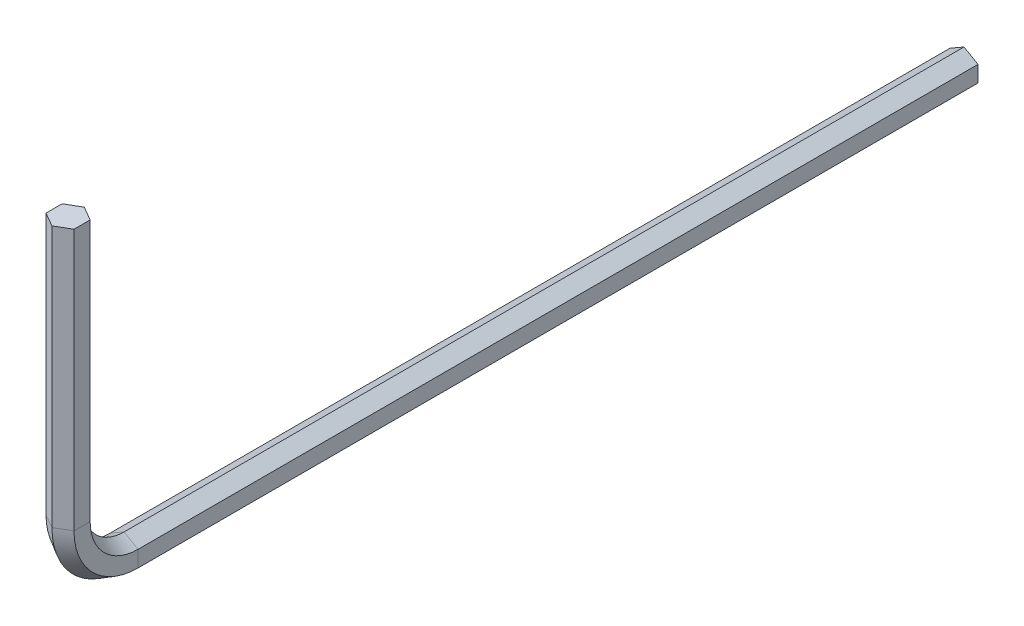
ISO-10303-21;
HEADER;
FILE_DESCRIPTION(('STEP AP214'),'2;1');
FILE_NAME('part.step','',(''),(''),'','','');
FILE_SCHEMA(('AUTOMOTIVE_DESIGN { 1 0 10303 214 1 1 1 1 }'));
ENDSEC;
DATA;
#1=APPLICATION_CONTEXT('core data for automotive mechanical design processes');
#2=APPLICATION_PROTOCOL_DEFINITION('international standard','automotive_design',2000,#1);
#3=PRODUCT_CONTEXT('',#1,'mechanical');
#4=PRODUCT('Part','Part','',(#3));
#5=PRODUCT_RELATED_PRODUCT_CATEGORY('part','',(#4));
#6=PRODUCT_DEFINITION_FORMATION('','',#4);
#7=PRODUCT_DEFINITION_CONTEXT('part definition',#1,'design');
#8=PRODUCT_DEFINITION('design','',#6,#7);
#9=PRODUCT_DEFINITION_SHAPE('','',#8);
#10=(LENGTH_UNIT() NAMED_UNIT(*) SI_UNIT(.MILLI.,.METRE.));
#11=(NAMED_UNIT(*) PLANE_ANGLE_UNIT() SI_UNIT($,.RADIAN.));
#12=(NAMED_UNIT(*) SI_UNIT($,.STERADIAN.) SOLID_ANGLE_UNIT());
#13=UNCERTAINTY_MEASURE_WITH_UNIT(LENGTH_MEASURE(1.E-05),#10,'distance_accuracy_value','');
#14=(GEOMETRIC_REPRESENTATION_CONTEXT(3) GLOBAL_UNCERTAINTY_ASSIGNED_CONTEXT((#13)) GLOBAL_UNIT_ASSIGNED_CONTEXT((#10,
#11,#12)) REPRESENTATION_CONTEXT('',''));
#15=CARTESIAN_POINT('',(0.,0.,0.));
#16=DIRECTION('',(0.,0.,1.));
#17=DIRECTION('',(1.,0.,0.));
#18=AXIS2_PLACEMENT_3D('',#15,#16,#17);
#19=CARTESIAN_POINT('',(0.,0.,0.));
#20=DIRECTION('',(0.,0.,1.));
#21=DIRECTION('',(1.,0.,0.));
#22=AXIS2_PLACEMENT_3D('',#19,#20,#21);
#23=PLANE('',#22);
#24=DIRECTION('',(-0.866025403784438,0.500000000000001,0.));
#25=VECTOR('',#24,1.);
#26=CARTESIAN_POINT('',(0.750000000000011,0.433012701892218,0.));
#27=LINE('',#26,#25);
#28=CARTESIAN_POINT('',(0.750000000000011,0.433012701892218,0.));
#29=VERTEX_POINT('',#28);
#30=CARTESIAN_POINT('',(0.,0.866025403784443,0.));
#31=VERTEX_POINT('',#30);
#32=EDGE_CURVE('E209',#29,#31,#27,.T.);
#33=ORIENTED_EDGE('',*,*,#32,.F.);
#34=DIRECTION('',(0.,1.,0.));
#35=VECTOR('',#34,1.);
#36=CARTESIAN_POINT('',(0.750000000000011,-0.433012701892232,0.));
#37=LINE('',#36,#35);
#38=CARTESIAN_POINT('',(0.750000000000011,-0.433012701892232,0.));
#39=VERTEX_POINT('',#38);
#40=EDGE_CURVE('E271',#39,#29,#37,.T.);
#41=ORIENTED_EDGE('',*,*,#40,.F.);
#42=DIRECTION('',(0.866025403784436,0.500000000000004,0.));
#43=VECTOR('',#42,1.);
#44=CARTESIAN_POINT('',(0.,-0.86602540378446,0.));
#45=LINE('',#44,#43);
#46=CARTESIAN_POINT('',(0.,-0.86602540378446,0.));
#47=VERTEX_POINT('',#46);
#48=EDGE_CURVE('E251',#47,#39,#45,.T.);
#49=ORIENTED_EDGE('',*,*,#48,.F.);
#50=DIRECTION('',(0.866025403784437,-0.500000000000003,0.));
#51=VECTOR('',#50,1.);
#52=CARTESIAN_POINT('',(-0.750000000000025,-0.433012701892221,0.));
#53=LINE('',#52,#51);
#54=CARTESIAN_POINT('',(-0.750000000000025,-0.433012701892221,0.));
#55=VERTEX_POINT('',#54);
#56=EDGE_CURVE('E155',#55,#47,#53,.T.);
#57=ORIENTED_EDGE('',*,*,#56,.F.);
#58=DIRECTION('',(0.,-1.,0.));
#59=VECTOR('',#58,1.);
#60=CARTESIAN_POINT('',(-0.750000000000011,0.433012701892225,0.));
#61=LINE('',#60,#59);
#62=CARTESIAN_POINT('',(-0.750000000000011,0.433012701892225,0.));
#63=VERTEX_POINT('',#62);
#64=EDGE_CURVE('E159',#63,#55,#61,.T.);
#65=ORIENTED_EDGE('',*,*,#64,.F.);
#66=DIRECTION('',(-0.866025403784444,-0.499999999999991,0.));
#67=VECTOR('',#66,1.);
#68=CARTESIAN_POINT('',(0.,0.866025403784443,0.));
#69=LINE('',#68,#67);
#70=EDGE_CURVE('E164',#31,#63,#69,.T.);
#71=ORIENTED_EDGE('',*,*,#70,.F.);
#72=EDGE_LOOP('',(#33,#41,#49,#57,#65,#71));
#73=FACE_BOUND('',#72,.T.);
#74=ADVANCED_FACE('F49',(#73),#23,.F.);
#75=CARTESIAN_POINT('',(0.,17.,48.));
#76=DIRECTION('',(0.,1.,0.));
#77=DIRECTION('',(1.,0.,0.));
#78=AXIS2_PLACEMENT_3D('',#75,#76,#77);
#79=PLANE('',#78);
#80=DIRECTION('',(-0.866025403784438,0.,-0.500000000000001));
#81=VECTOR('',#80,1.);
#82=CARTESIAN_POINT('',(0.750000000000011,17.,47.5669872981078));
#83=LINE('',#82,#81);
#84=CARTESIAN_POINT('',(0.750000000000011,17.,47.5669872981078));
#85=VERTEX_POINT('',#84);
#86=CARTESIAN_POINT('',(0.,17.,47.1339745962156));
#87=VERTEX_POINT('',#86);
#88=EDGE_CURVE('E176',#85,#87,#83,.T.);
#89=ORIENTED_EDGE('',*,*,#88,.T.);
#90=DIRECTION('',(-0.866025403784444,0.,0.499999999999991));
#91=VECTOR('',#90,1.);
#92=CARTESIAN_POINT('',(0.,17.,47.1339745962156));
#93=LINE('',#92,#91);
#94=CARTESIAN_POINT('',(-0.750000000000011,17.,47.5669872981078));
#95=VERTEX_POINT('',#94);
#96=EDGE_CURVE('E179',#87,#95,#93,.T.);
#97=ORIENTED_EDGE('',*,*,#96,.T.);
#98=DIRECTION('',(0.,0.,1.));
#99=VECTOR('',#98,1.);
#100=CARTESIAN_POINT('',(-0.750000000000011,17.,47.5669872981078));
#101=LINE('',#100,#99);
#102=CARTESIAN_POINT('',(-0.750000000000025,17.,48.4330127018922));
#103=VERTEX_POINT('',#102);
#104=EDGE_CURVE('E229',#95,#103,#101,.T.);
#105=ORIENTED_EDGE('',*,*,#104,.T.);
#106=DIRECTION('',(0.866025403784437,0.,0.500000000000003));
#107=VECTOR('',#106,1.);
#108=CARTESIAN_POINT('',(-0.750000000000025,17.,48.4330127018922));
#109=LINE('',#108,#107);
#110=CARTESIAN_POINT('',(0.,17.,48.8660254037845));
#111=VERTEX_POINT('',#110);
#112=EDGE_CURVE('E69',#103,#111,#109,.T.);
#113=ORIENTED_EDGE('',*,*,#112,.T.);
#114=DIRECTION('',(0.866025403784436,0.,-0.500000000000004));
#115=VECTOR('',#114,1.);
#116=CARTESIAN_POINT('',(0.,17.,48.8660254037845));
#117=LINE('',#116,#115);
#118=CARTESIAN_POINT('',(0.750000000000011,17.,48.4330127018922));
#119=VERTEX_POINT('',#118);
#120=EDGE_CURVE('E63',#111,#119,#117,.T.);
#121=ORIENTED_EDGE('',*,*,#120,.T.);
#122=DIRECTION('',(0.,0.,-1.));
#123=VECTOR('',#122,1.);
#124=CARTESIAN_POINT('',(0.750000000000011,17.,48.4330127018922));
#125=LINE('',#124,#123);
#126=EDGE_CURVE('E11',#119,#85,#125,.T.);
#127=ORIENTED_EDGE('',*,*,#126,.T.);
#128=EDGE_LOOP('',(#89,#97,#105,#113,#121,#127));
#129=FACE_BOUND('',#128,.T.);
#130=ADVANCED_FACE('F178',(#129),#79,.T.);
#131=CARTESIAN_POINT('',(0.750000000000011,0.433012701892218,0.));
#132=DIRECTION('',(0.500000000000001,0.866025403784438,0.));
#133=DIRECTION('',(-0.866025403784438,0.500000000000001,0.));
#134=AXIS2_PLACEMENT_3D('',#131,#132,#133);
#135=PLANE('',#134);
#136=DIRECTION('',(0.,0.,1.));
#137=VECTOR('',#136,1.);
#138=CARTESIAN_POINT('',(0.,0.866025403784443,0.));
#139=LINE('',#138,#137);
#140=CARTESIAN_POINT('',(0.,0.866025403784443,45.));
#141=VERTEX_POINT('',#140);
#142=EDGE_CURVE('E215',#31,#141,#139,.T.);
#143=ORIENTED_EDGE('',*,*,#142,.T.);
#144=DIRECTION('',(-0.866025403784438,0.500000000000001,0.));
#145=VECTOR('',#144,1.);
#146=CARTESIAN_POINT('',(0.750000000000011,0.433012701892218,45.));
#147=LINE('',#146,#145);
#148=CARTESIAN_POINT('',(0.750000000000011,0.433012701892218,45.));
#149=VERTEX_POINT('',#148);
#150=EDGE_CURVE('E316',#149,#141,#147,.T.);
#151=ORIENTED_EDGE('',*,*,#150,.F.);
#152=DIRECTION('',(0.,0.,1.));
#153=VECTOR('',#152,1.);
#154=CARTESIAN_POINT('',(0.750000000000011,0.433012701892218,0.));
#155=LINE('',#154,#153);
#156=EDGE_CURVE('E292',#29,#149,#155,.T.);
#157=ORIENTED_EDGE('',*,*,#156,.F.);
#158=ORIENTED_EDGE('',*,*,#32,.T.);
#159=EDGE_LOOP('',(#143,#151,#157,#158));
#160=FACE_BOUND('',#159,.T.);
#161=ADVANCED_FACE('F326',(#160),#135,.T.);
#162=CARTESIAN_POINT('',(0.,0.866025403784443,0.));
#163=DIRECTION('',(-0.499999999999991,0.866025403784444,0.));
#164=DIRECTION('',(-0.866025403784444,-0.499999999999991,0.));
#165=AXIS2_PLACEMENT_3D('',#162,#163,#164);
#166=PLANE('',#165);
#167=DIRECTION('',(0.,0.,1.));
#168=VECTOR('',#167,1.);
#169=CARTESIAN_POINT('',(-0.750000000000011,0.433012701892225,0.));
#170=LINE('',#169,#168);
#171=CARTESIAN_POINT('',(-0.750000000000011,0.433012701892225,45.));
#172=VERTEX_POINT('',#171);
#173=EDGE_CURVE('E214',#63,#172,#170,.T.);
#174=ORIENTED_EDGE('',*,*,#173,.T.);
#175=DIRECTION('',(-0.866025403784444,-0.499999999999991,0.));
#176=VECTOR('',#175,1.);
#177=CARTESIAN_POINT('',(0.,0.866025403784443,45.));
#178=LINE('',#177,#176);
#179=EDGE_CURVE('E210',#141,#172,#178,.T.);
#180=ORIENTED_EDGE('',*,*,#179,.F.);
#181=ORIENTED_EDGE('',*,*,#142,.F.);
#182=ORIENTED_EDGE('',*,*,#70,.T.);
#183=EDGE_LOOP('',(#174,#180,#181,#182));
#184=FACE_BOUND('',#183,.T.);
#185=ADVANCED_FACE('F329',(#184),#166,.T.);
#186=CARTESIAN_POINT('',(-0.750000000000011,0.433012701892225,0.));
#187=DIRECTION('',(-1.,0.,0.));
#188=DIRECTION('',(0.,-1.,0.));
#189=AXIS2_PLACEMENT_3D('',#186,#187,#188);
#190=PLANE('',#189);
#191=DIRECTION('',(0.,0.,1.));
#192=VECTOR('',#191,1.);
#193=CARTESIAN_POINT('',(-0.750000000000025,-0.433012701892221,0.));
#194=LINE('',#193,#192);
#195=CARTESIAN_POINT('',(-0.750000000000025,-0.433012701892221,45.));
#196=VERTEX_POINT('',#195);
#197=EDGE_CURVE('E234',#55,#196,#194,.T.);
#198=ORIENTED_EDGE('',*,*,#197,.T.);
#199=DIRECTION('',(0.,-1.,0.));
#200=VECTOR('',#199,1.);
#201=CARTESIAN_POINT('',(-0.750000000000011,0.433012701892225,45.));
#202=LINE('',#201,#200);
#203=EDGE_CURVE('E219',#172,#196,#202,.T.);
#204=ORIENTED_EDGE('',*,*,#203,.F.);
#205=ORIENTED_EDGE('',*,*,#173,.F.);
#206=ORIENTED_EDGE('',*,*,#64,.T.);
#207=EDGE_LOOP('',(#198,#204,#205,#206));
#208=FACE_BOUND('',#207,.T.);
#209=ADVANCED_FACE('F385',(#208),#190,.T.);
#210=CARTESIAN_POINT('',(-0.750000000000025,-0.433012701892221,0.));
#211=DIRECTION('',(-0.500000000000003,-0.866025403784437,0.));
#212=DIRECTION('',(0.866025403784437,-0.500000000000003,0.));
#213=AXIS2_PLACEMENT_3D('',#210,#211,#212);
#214=PLANE('',#213);
#215=DIRECTION('',(0.,0.,1.));
#216=VECTOR('',#215,1.);
#217=CARTESIAN_POINT('',(0.,-0.86602540378446,0.));
#218=LINE('',#217,#216);
#219=CARTESIAN_POINT('',(0.,-0.86602540378446,45.));
#220=VERTEX_POINT('',#219);
#221=EDGE_CURVE('E254',#47,#220,#218,.T.);
#222=ORIENTED_EDGE('',*,*,#221,.T.);
#223=DIRECTION('',(0.866025403784437,-0.500000000000003,0.));
#224=VECTOR('',#223,1.);
#225=CARTESIAN_POINT('',(-0.750000000000025,-0.433012701892221,45.));
#226=LINE('',#225,#224);
#227=EDGE_CURVE('E238',#196,#220,#226,.T.);
#228=ORIENTED_EDGE('',*,*,#227,.F.);
#229=ORIENTED_EDGE('',*,*,#197,.F.);
#230=ORIENTED_EDGE('',*,*,#56,.T.);
#231=EDGE_LOOP('',(#222,#228,#229,#230));
#232=FACE_BOUND('',#231,.T.);
#233=ADVANCED_FACE('F393',(#232),#214,.T.);
#234=CARTESIAN_POINT('',(0.,-0.86602540378446,0.));
#235=DIRECTION('',(0.500000000000004,-0.866025403784436,0.));
#236=DIRECTION('',(0.866025403784436,0.500000000000004,0.));
#237=AXIS2_PLACEMENT_3D('',#234,#235,#236);
#238=PLANE('',#237);
#239=DIRECTION('',(0.,0.,1.));
#240=VECTOR('',#239,1.);
#241=CARTESIAN_POINT('',(0.750000000000011,-0.433012701892232,0.));
#242=LINE('',#241,#240);
#243=CARTESIAN_POINT('',(0.750000000000011,-0.433012701892232,45.));
#244=VERTEX_POINT('',#243);
#245=EDGE_CURVE('E274',#39,#244,#242,.T.);
#246=ORIENTED_EDGE('',*,*,#245,.T.);
#247=DIRECTION('',(0.866025403784436,0.500000000000004,0.));
#248=VECTOR('',#247,1.);
#249=CARTESIAN_POINT('',(0.,-0.86602540378446,45.));
#250=LINE('',#249,#248);
#251=EDGE_CURVE('E258',#220,#244,#250,.T.);
#252=ORIENTED_EDGE('',*,*,#251,.F.);
#253=ORIENTED_EDGE('',*,*,#221,.F.);
#254=ORIENTED_EDGE('',*,*,#48,.T.);
#255=EDGE_LOOP('',(#246,#252,#253,#254));
#256=FACE_BOUND('',#255,.T.);
#257=ADVANCED_FACE('F403',(#256),#238,.T.);
#258=CARTESIAN_POINT('',(0.750000000000011,-0.433012701892232,0.));
#259=DIRECTION('',(1.,0.,0.));
#260=DIRECTION('',(0.,0.,-1.));
#261=AXIS2_PLACEMENT_3D('',#258,#259,#260);
#262=PLANE('',#261);
#263=DIRECTION('',(0.,1.,0.));
#264=VECTOR('',#263,1.);
#265=CARTESIAN_POINT('',(0.750000000000011,-0.433012701892232,45.));
#266=LINE('',#265,#264);
#267=EDGE_CURVE('E278',#244,#149,#266,.T.);
#268=ORIENTED_EDGE('',*,*,#267,.F.);
#269=ORIENTED_EDGE('',*,*,#245,.F.);
#270=ORIENTED_EDGE('',*,*,#40,.T.);
#271=ORIENTED_EDGE('',*,*,#156,.T.);
#272=EDGE_LOOP('',(#268,#269,#270,#271));
#273=FACE_BOUND('',#272,.T.);
#274=ADVANCED_FACE('F342',(#273),#262,.T.);
#275=CARTESIAN_POINT('',(0.750000000000011,3.,45.));
#276=DIRECTION('',(1.,0.,0.));
#277=DIRECTION('',(0.,0.,-1.));
#278=AXIS2_PLACEMENT_3D('',#275,#276,#277);
#279=CONICAL_SURFACE('',#278,2.56698729810778,0.5235987755983);
#280=CARTESIAN_POINT('',(0.,3.,45.));
#281=DIRECTION('',(-1.,0.,0.));
#282=DIRECTION('',(0.,-1.,0.));
#283=AXIS2_PLACEMENT_3D('',#280,#281,#282);
#284=CIRCLE('',#283,2.13397459621556);
#285=CARTESIAN_POINT('',(0.,3.,47.1339745962156));
#286=VERTEX_POINT('',#285);
#287=EDGE_CURVE('E223',#141,#286,#284,.T.);
#288=ORIENTED_EDGE('',*,*,#287,.T.);
#289=DIRECTION('',(-0.866025403784438,0.,-0.500000000000001));
#290=VECTOR('',#289,1.);
#291=CARTESIAN_POINT('',(0.750000000000011,3.,47.5669872981078));
#292=LINE('',#291,#290);
#293=CARTESIAN_POINT('',(0.750000000000011,3.,47.5669872981078));
#294=VERTEX_POINT('',#293);
#295=EDGE_CURVE('E199',#294,#286,#292,.T.);
#296=ORIENTED_EDGE('',*,*,#295,.F.);
#297=CARTESIAN_POINT('',(0.750000000000011,3.,45.));
#298=DIRECTION('',(-1.,0.,0.));
#299=DIRECTION('',(0.,-1.,0.));
#300=AXIS2_PLACEMENT_3D('',#297,#298,#299);
#301=CIRCLE('',#300,2.56698729810778);
#302=EDGE_CURVE('E295',#149,#294,#301,.T.);
#303=ORIENTED_EDGE('',*,*,#302,.F.);
#304=ORIENTED_EDGE('',*,*,#150,.T.);
#305=EDGE_LOOP('',(#288,#296,#303,#304));
#306=FACE_BOUND('',#305,.T.);
#307=ADVANCED_FACE('F302',(#306),#279,.F.);
#308=CARTESIAN_POINT('',(0.,3.,45.));
#309=DIRECTION('',(-1.,0.,0.));
#310=DIRECTION('',(0.,0.,1.));
#311=AXIS2_PLACEMENT_3D('',#308,#309,#310);
#312=CONICAL_SURFACE('',#311,2.13397459621556,0.523598775598288);
#313=CARTESIAN_POINT('',(-0.750000000000011,3.,45.));
#314=DIRECTION('',(-1.,0.,0.));
#315=DIRECTION('',(0.,-1.,0.));
#316=AXIS2_PLACEMENT_3D('',#313,#314,#315);
#317=CIRCLE('',#316,2.56698729810778);
#318=CARTESIAN_POINT('',(-0.750000000000011,3.,47.5669872981078));
#319=VERTEX_POINT('',#318);
#320=EDGE_CURVE('E141',#172,#319,#317,.T.);
#321=ORIENTED_EDGE('',*,*,#320,.T.);
#322=DIRECTION('',(-0.866025403784444,0.,0.499999999999991));
#323=VECTOR('',#322,1.);
#324=CARTESIAN_POINT('',(0.,3.,47.1339745962156));
#325=LINE('',#324,#323);
#326=EDGE_CURVE('E220',#286,#319,#325,.T.);
#327=ORIENTED_EDGE('',*,*,#326,.F.);
#328=ORIENTED_EDGE('',*,*,#287,.F.);
#329=ORIENTED_EDGE('',*,*,#179,.T.);
#330=EDGE_LOOP('',(#321,#327,#328,#329));
#331=FACE_BOUND('',#330,.T.);
#332=ADVANCED_FACE('F332',(#331),#312,.F.);
#333=CARTESIAN_POINT('',(-0.750000000000018,0.433012701892224,45.));
#334=DIRECTION('',(-1.,0.,0.));
#335=DIRECTION('',(0.,0.,1.));
#336=AXIS2_PLACEMENT_3D('',#333,#334,#335);
#337=PLANE('',#336);
#338=CARTESIAN_POINT('',(-0.750000000000025,3.,45.));
#339=DIRECTION('',(-1.,0.,0.));
#340=DIRECTION('',(0.,-1.,0.));
#341=AXIS2_PLACEMENT_3D('',#338,#339,#340);
#342=CIRCLE('',#341,3.43301270189222);
#343=CARTESIAN_POINT('',(-0.750000000000025,3.,48.4330127018922));
#344=VERTEX_POINT('',#343);
#345=EDGE_CURVE('E132',#196,#344,#342,.T.);
#346=ORIENTED_EDGE('',*,*,#345,.T.);
#347=DIRECTION('',(0.,0.,1.));
#348=VECTOR('',#347,1.);
#349=CARTESIAN_POINT('',(-0.750000000000011,3.,47.5669872981078));
#350=LINE('',#349,#348);
#351=EDGE_CURVE('E225',#319,#344,#350,.T.);
#352=ORIENTED_EDGE('',*,*,#351,.F.);
#353=ORIENTED_EDGE('',*,*,#320,.F.);
#354=ORIENTED_EDGE('',*,*,#203,.T.);
#355=EDGE_LOOP('',(#346,#352,#353,#354));
#356=FACE_BOUND('',#355,.T.);
#357=ADVANCED_FACE('F334',(#356),#337,.T.);
#358=CARTESIAN_POINT('',(-0.750000000000025,3.,45.));
#359=DIRECTION('',(1.,0.,0.));
#360=DIRECTION('',(0.,0.,-1.));
#361=AXIS2_PLACEMENT_3D('',#358,#359,#360);
#362=CONICAL_SURFACE('',#361,3.43301270189222,0.523598775598302);
#363=CARTESIAN_POINT('',(0.,3.,45.));
#364=DIRECTION('',(-1.,0.,0.));
#365=DIRECTION('',(0.,-1.,0.));
#366=AXIS2_PLACEMENT_3D('',#363,#364,#365);
#367=CIRCLE('',#366,3.86602540378446);
#368=CARTESIAN_POINT('',(0.,3.,48.8660254037845));
#369=VERTEX_POINT('',#368);
#370=EDGE_CURVE('E125',#220,#369,#367,.T.);
#371=ORIENTED_EDGE('',*,*,#370,.T.);
#372=DIRECTION('',(0.866025403784437,0.,0.500000000000003));
#373=VECTOR('',#372,1.);
#374=CARTESIAN_POINT('',(-0.750000000000025,3.,48.4330127018922));
#375=LINE('',#374,#373);
#376=EDGE_CURVE('E244',#344,#369,#375,.T.);
#377=ORIENTED_EDGE('',*,*,#376,.F.);
#378=ORIENTED_EDGE('',*,*,#345,.F.);
#379=ORIENTED_EDGE('',*,*,#227,.T.);
#380=EDGE_LOOP('',(#371,#377,#378,#379));
#381=FACE_BOUND('',#380,.T.);
#382=ADVANCED_FACE('F340',(#381),#362,.T.);
#383=CARTESIAN_POINT('',(0.,3.,45.));
#384=DIRECTION('',(-1.,0.,0.));
#385=DIRECTION('',(0.,0.,1.));
#386=AXIS2_PLACEMENT_3D('',#383,#384,#385);
#387=CONICAL_SURFACE('',#386,3.86602540378446,0.523598775598303);
#388=CARTESIAN_POINT('',(0.750000000000011,3.,45.));
#389=DIRECTION('',(-1.,0.,0.));
#390=DIRECTION('',(0.,-1.,0.));
#391=AXIS2_PLACEMENT_3D('',#388,#389,#390);
#392=CIRCLE('',#391,3.43301270189223);
#393=CARTESIAN_POINT('',(0.750000000000011,3.,48.4330127018922));
#394=VERTEX_POINT('',#393);
#395=EDGE_CURVE('E281',#244,#394,#392,.T.);
#396=ORIENTED_EDGE('',*,*,#395,.T.);
#397=DIRECTION('',(0.866025403784436,0.,-0.500000000000004));
#398=VECTOR('',#397,1.);
#399=CARTESIAN_POINT('',(0.,3.,48.8660254037845));
#400=LINE('',#399,#398);
#401=EDGE_CURVE('E263',#369,#394,#400,.T.);
#402=ORIENTED_EDGE('',*,*,#401,.F.);
#403=ORIENTED_EDGE('',*,*,#370,.F.);
#404=ORIENTED_EDGE('',*,*,#251,.T.);
#405=EDGE_LOOP('',(#396,#402,#403,#404));
#406=FACE_BOUND('',#405,.T.);
#407=ADVANCED_FACE('F448',(#406),#387,.T.);
#408=CARTESIAN_POINT('',(0.750000000000011,-0.433012701892233,45.));
#409=DIRECTION('',(1.,0.,0.));
#410=DIRECTION('',(0.,0.,-1.));
#411=AXIS2_PLACEMENT_3D('',#408,#409,#410);
#412=PLANE('',#411);
#413=DIRECTION('',(0.,0.,-1.));
#414=VECTOR('',#413,1.);
#415=CARTESIAN_POINT('',(0.750000000000011,3.,48.4330127018922));
#416=LINE('',#415,#414);
#417=EDGE_CURVE('E206',#394,#294,#416,.T.);
#418=ORIENTED_EDGE('',*,*,#417,.F.);
#419=ORIENTED_EDGE('',*,*,#395,.F.);
#420=ORIENTED_EDGE('',*,*,#267,.T.);
#421=ORIENTED_EDGE('',*,*,#302,.T.);
#422=EDGE_LOOP('',(#418,#419,#420,#421));
#423=FACE_BOUND('',#422,.T.);
#424=ADVANCED_FACE('F306',(#423),#412,.T.);
#425=CARTESIAN_POINT('',(0.750000000000011,3.,47.5669872981078));
#426=DIRECTION('',(0.500000000000001,0.,-0.866025403784438));
#427=DIRECTION('',(-0.866025403784438,0.,-0.500000000000001));
#428=AXIS2_PLACEMENT_3D('',#425,#426,#427);
#429=PLANE('',#428);
#430=DIRECTION('',(0.,1.,0.));
#431=VECTOR('',#430,1.);
#432=CARTESIAN_POINT('',(0.,3.,47.1339745962156));
#433=LINE('',#432,#431);
#434=EDGE_CURVE('E185',#286,#87,#433,.T.);
#435=ORIENTED_EDGE('',*,*,#434,.T.);
#436=ORIENTED_EDGE('',*,*,#88,.F.);
#437=DIRECTION('',(0.,1.,0.));
#438=VECTOR('',#437,1.);
#439=CARTESIAN_POINT('',(0.750000000000011,3.,47.5669872981078));
#440=LINE('',#439,#438);
#441=EDGE_CURVE('E186',#294,#85,#440,.T.);
#442=ORIENTED_EDGE('',*,*,#441,.F.);
#443=ORIENTED_EDGE('',*,*,#295,.T.);
#444=EDGE_LOOP('',(#435,#436,#442,#443));
#445=FACE_BOUND('',#444,.T.);
#446=ADVANCED_FACE('F197',(#445),#429,.T.);
#447=CARTESIAN_POINT('',(0.,3.,47.1339745962156));
#448=DIRECTION('',(-0.499999999999991,0.,-0.866025403784444));
#449=DIRECTION('',(-0.866025403784444,0.,0.499999999999991));
#450=AXIS2_PLACEMENT_3D('',#447,#448,#449);
#451=PLANE('',#450);
#452=DIRECTION('',(0.,1.,0.));
#453=VECTOR('',#452,1.);
#454=CARTESIAN_POINT('',(-0.750000000000011,3.,47.5669872981078));
#455=LINE('',#454,#453);
#456=EDGE_CURVE('E193',#319,#95,#455,.T.);
#457=ORIENTED_EDGE('',*,*,#456,.T.);
#458=ORIENTED_EDGE('',*,*,#96,.F.);
#459=ORIENTED_EDGE('',*,*,#434,.F.);
#460=ORIENTED_EDGE('',*,*,#326,.T.);
#461=EDGE_LOOP('',(#457,#458,#459,#460));
#462=FACE_BOUND('',#461,.T.);
#463=ADVANCED_FACE('F190',(#462),#451,.T.);
#464=CARTESIAN_POINT('',(-0.750000000000011,3.,47.5669872981078));
#465=DIRECTION('',(-1.,0.,0.));
#466=DIRECTION('',(0.,0.,1.));
#467=AXIS2_PLACEMENT_3D('',#464,#465,#466);
#468=PLANE('',#467);
#469=DIRECTION('',(0.,1.,0.));
#470=VECTOR('',#469,1.);
#471=CARTESIAN_POINT('',(-0.750000000000025,3.,48.4330127018922));
#472=LINE('',#471,#470);
#473=EDGE_CURVE('E108',#344,#103,#472,.T.);
#474=ORIENTED_EDGE('',*,*,#473,.T.);
#475=ORIENTED_EDGE('',*,*,#104,.F.);
#476=ORIENTED_EDGE('',*,*,#456,.F.);
#477=ORIENTED_EDGE('',*,*,#351,.T.);
#478=EDGE_LOOP('',(#474,#475,#476,#477));
#479=FACE_BOUND('',#478,.T.);
#480=ADVANCED_FACE('F480',(#479),#468,.T.);
#481=CARTESIAN_POINT('',(-0.750000000000025,3.,48.4330127018922));
#482=DIRECTION('',(-0.500000000000003,0.,0.866025403784437));
#483=DIRECTION('',(0.866025403784437,0.,0.500000000000003));
#484=AXIS2_PLACEMENT_3D('',#481,#482,#483);
#485=PLANE('',#484);
#486=DIRECTION('',(0.,1.,0.));
#487=VECTOR('',#486,1.);
#488=CARTESIAN_POINT('',(0.,3.,48.8660254037845));
#489=LINE('',#488,#487);
#490=EDGE_CURVE('E100',#369,#111,#489,.T.);
#491=ORIENTED_EDGE('',*,*,#490,.T.);
#492=ORIENTED_EDGE('',*,*,#112,.F.);
#493=ORIENTED_EDGE('',*,*,#473,.F.);
#494=ORIENTED_EDGE('',*,*,#376,.T.);
#495=EDGE_LOOP('',(#491,#492,#493,#494));
#496=FACE_BOUND('',#495,.T.);
#497=ADVANCED_FACE('F352',(#496),#485,.T.);
#498=CARTESIAN_POINT('',(0.,3.,48.8660254037845));
#499=DIRECTION('',(0.500000000000004,0.,0.866025403784436));
#500=DIRECTION('',(0.866025403784436,0.,-0.500000000000004));
#501=AXIS2_PLACEMENT_3D('',#498,#499,#500);
#502=PLANE('',#501);
#503=DIRECTION('',(0.,1.,0.));
#504=VECTOR('',#503,1.);
#505=CARTESIAN_POINT('',(0.750000000000011,3.,48.4330127018922));
#506=LINE('',#505,#504);
#507=EDGE_CURVE('E57',#394,#119,#506,.T.);
#508=ORIENTED_EDGE('',*,*,#507,.T.);
#509=ORIENTED_EDGE('',*,*,#120,.F.);
#510=ORIENTED_EDGE('',*,*,#490,.F.);
#511=ORIENTED_EDGE('',*,*,#401,.T.);
#512=EDGE_LOOP('',(#508,#509,#510,#511));
#513=FACE_BOUND('',#512,.T.);
#514=ADVANCED_FACE('F347',(#513),#502,.T.);
#515=CARTESIAN_POINT('',(0.750000000000011,3.,48.4330127018922));
#516=DIRECTION('',(1.,0.,0.));
#517=DIRECTION('',(0.,0.,-1.));
#518=AXIS2_PLACEMENT_3D('',#515,#516,#517);
#519=PLANE('',#518);
#520=ORIENTED_EDGE('',*,*,#126,.F.);
#521=ORIENTED_EDGE('',*,*,#507,.F.);
#522=ORIENTED_EDGE('',*,*,#417,.T.);
#523=ORIENTED_EDGE('',*,*,#441,.T.);
#524=EDGE_LOOP('',(#520,#521,#522,#523));
#525=FACE_BOUND('',#524,.T.);
#526=ADVANCED_FACE('F297',(#525),#519,.T.);
#527=CLOSED_SHELL('',(#74,#130,#161,#185,#209,#233,#257,#274,#307,#332,#357,#382,#407,#424,#446,
#463,#480,#497,#514,#526));
#528=MANIFOLD_SOLID_BREP('B2',#527);
#529=ADVANCED_BREP_SHAPE_REPRESENTATION('',(#18,#528),#14);
#530=SHAPE_DEFINITION_REPRESENTATION(#9,#529);
ENDSEC;
END-ISO-10303-21;
